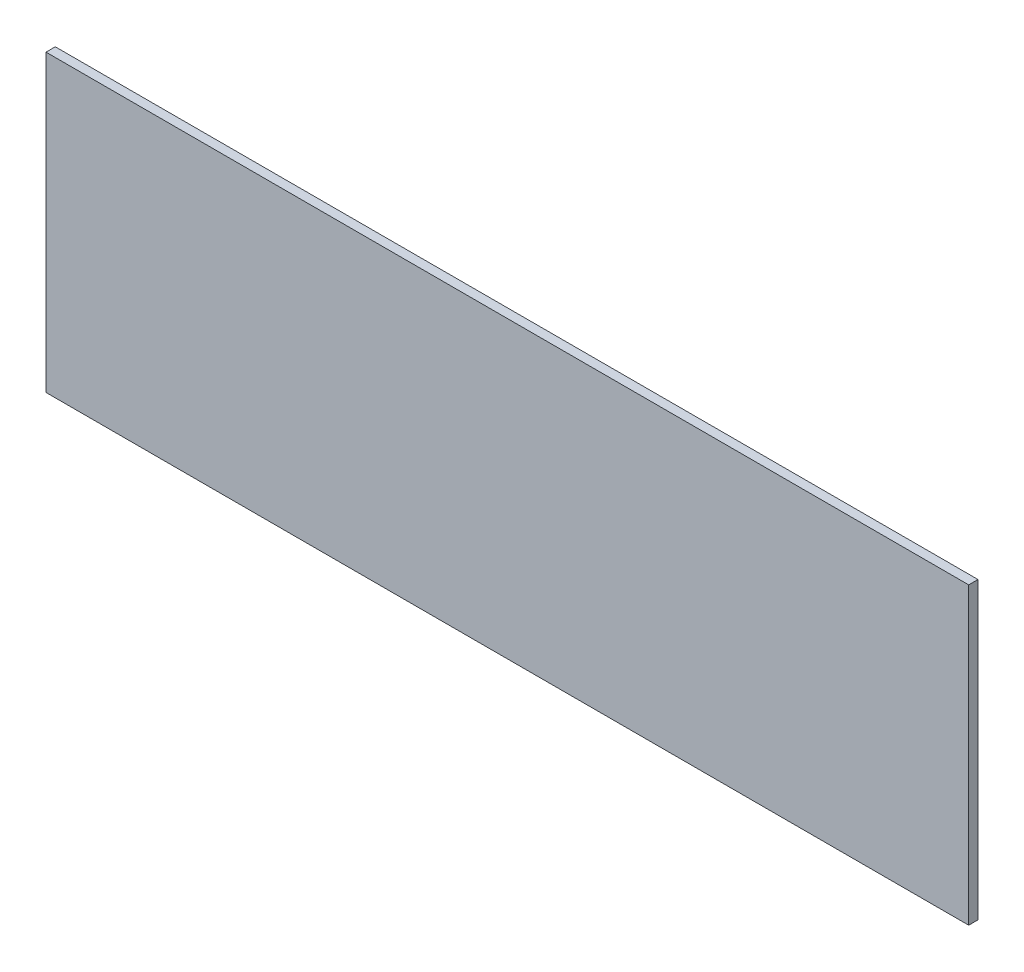
ISO-10303-21;
HEADER;
FILE_DESCRIPTION(('STEP AP214'),'2;1');
FILE_NAME('part.step','',(''),(''),'','','');
FILE_SCHEMA(('AUTOMOTIVE_DESIGN { 1 0 10303 214 1 1 1 1 }'));
ENDSEC;
DATA;
#1=APPLICATION_CONTEXT('core data for automotive mechanical design processes');
#2=APPLICATION_PROTOCOL_DEFINITION('international standard','automotive_design',2000,#1);
#3=PRODUCT_CONTEXT('',#1,'mechanical');
#4=PRODUCT('Part','Part','',(#3));
#5=PRODUCT_RELATED_PRODUCT_CATEGORY('part','',(#4));
#6=PRODUCT_DEFINITION_FORMATION('','',#4);
#7=PRODUCT_DEFINITION_CONTEXT('part definition',#1,'design');
#8=PRODUCT_DEFINITION('design','',#6,#7);
#9=PRODUCT_DEFINITION_SHAPE('','',#8);
#10=(LENGTH_UNIT() NAMED_UNIT(*) SI_UNIT(.MILLI.,.METRE.));
#11=(NAMED_UNIT(*) PLANE_ANGLE_UNIT() SI_UNIT($,.RADIAN.));
#12=(NAMED_UNIT(*) SI_UNIT($,.STERADIAN.) SOLID_ANGLE_UNIT());
#13=UNCERTAINTY_MEASURE_WITH_UNIT(LENGTH_MEASURE(1.E-05),#10,'distance_accuracy_value','');
#14=(GEOMETRIC_REPRESENTATION_CONTEXT(3) GLOBAL_UNCERTAINTY_ASSIGNED_CONTEXT((#13)) GLOBAL_UNIT_ASSIGNED_CONTEXT((#10,
#11,#12)) REPRESENTATION_CONTEXT('',''));
#15=CARTESIAN_POINT('',(0.,0.,0.));
#16=DIRECTION('',(0.,0.,1.));
#17=DIRECTION('',(1.,0.,0.));
#18=AXIS2_PLACEMENT_3D('',#15,#16,#17);
#19=CARTESIAN_POINT('',(150.078,-60.96,3.));
#20=DIRECTION('',(0.,-1.,0.));
#21=DIRECTION('',(1.,0.,0.));
#22=AXIS2_PLACEMENT_3D('',#19,#20,#21);
#23=PLANE('',#22);
#24=DIRECTION('',(-1.,0.,0.));
#25=VECTOR('',#24,1.);
#26=CARTESIAN_POINT('',(150.078,-60.96,0.));
#27=LINE('',#26,#25);
#28=CARTESIAN_POINT('',(150.078,-60.96,0.));
#29=VERTEX_POINT('',#28);
#30=CARTESIAN_POINT('',(-148.082,-60.96,0.));
#31=VERTEX_POINT('',#30);
#32=EDGE_CURVE('E114',#29,#31,#27,.T.);
#33=ORIENTED_EDGE('',*,*,#32,.F.);
#34=DIRECTION('',(0.,0.,-1.));
#35=VECTOR('',#34,1.);
#36=CARTESIAN_POINT('',(150.078,-60.96,3.));
#37=LINE('',#36,#35);
#38=CARTESIAN_POINT('',(150.078,-60.96,3.));
#39=VERTEX_POINT('',#38);
#40=EDGE_CURVE('E11',#39,#29,#37,.T.);
#41=ORIENTED_EDGE('',*,*,#40,.F.);
#42=DIRECTION('',(-1.,0.,0.));
#43=VECTOR('',#42,1.);
#44=CARTESIAN_POINT('',(150.078,-60.96,3.));
#45=LINE('',#44,#43);
#46=CARTESIAN_POINT('',(-148.082,-60.96,3.));
#47=VERTEX_POINT('',#46);
#48=EDGE_CURVE('E106',#39,#47,#45,.T.);
#49=ORIENTED_EDGE('',*,*,#48,.T.);
#50=DIRECTION('',(0.,0.,-1.));
#51=VECTOR('',#50,1.);
#52=CARTESIAN_POINT('',(-148.082,-60.96,3.));
#53=LINE('',#52,#51);
#54=EDGE_CURVE('E46',#47,#31,#53,.T.);
#55=ORIENTED_EDGE('',*,*,#54,.T.);
#56=EDGE_LOOP('',(#33,#41,#49,#55));
#57=FACE_BOUND('',#56,.T.);
#58=ADVANCED_FACE('F43',(#57),#23,.T.);
#59=CARTESIAN_POINT('',(150.078,-60.96,3.));
#60=DIRECTION('',(-1.,0.,0.));
#61=DIRECTION('',(0.,0.,1.));
#62=AXIS2_PLACEMENT_3D('',#59,#60,#61);
#63=PLANE('',#62);
#64=DIRECTION('',(0.,1.,0.));
#65=VECTOR('',#64,1.);
#66=CARTESIAN_POINT('',(150.078,-60.96,0.));
#67=LINE('',#66,#65);
#68=CARTESIAN_POINT('',(150.078,34.29,0.));
#69=VERTEX_POINT('',#68);
#70=EDGE_CURVE('E109',#29,#69,#67,.T.);
#71=ORIENTED_EDGE('',*,*,#70,.T.);
#72=DIRECTION('',(0.,0.,-1.));
#73=VECTOR('',#72,1.);
#74=CARTESIAN_POINT('',(150.078,34.29,3.));
#75=LINE('',#74,#73);
#76=CARTESIAN_POINT('',(150.078,34.29,3.));
#77=VERTEX_POINT('',#76);
#78=EDGE_CURVE('E53',#77,#69,#75,.T.);
#79=ORIENTED_EDGE('',*,*,#78,.F.);
#80=DIRECTION('',(0.,1.,0.));
#81=VECTOR('',#80,1.);
#82=CARTESIAN_POINT('',(150.078,-60.96,3.));
#83=LINE('',#82,#81);
#84=EDGE_CURVE('E101',#39,#77,#83,.T.);
#85=ORIENTED_EDGE('',*,*,#84,.F.);
#86=ORIENTED_EDGE('',*,*,#40,.T.);
#87=EDGE_LOOP('',(#71,#79,#85,#86));
#88=FACE_BOUND('',#87,.T.);
#89=ADVANCED_FACE('F129',(#88),#63,.F.);
#90=CARTESIAN_POINT('',(-148.082,34.29,3.));
#91=DIRECTION('',(0.,1.,0.));
#92=DIRECTION('',(-1.,0.,0.));
#93=AXIS2_PLACEMENT_3D('',#90,#91,#92);
#94=PLANE('',#93);
#95=DIRECTION('',(1.,0.,0.));
#96=VECTOR('',#95,1.);
#97=CARTESIAN_POINT('',(-148.082,34.29,0.));
#98=LINE('',#97,#96);
#99=CARTESIAN_POINT('',(-148.082,34.29,0.));
#100=VERTEX_POINT('',#99);
#101=EDGE_CURVE('E94',#100,#69,#98,.T.);
#102=ORIENTED_EDGE('',*,*,#101,.F.);
#103=DIRECTION('',(0.,0.,-1.));
#104=VECTOR('',#103,1.);
#105=CARTESIAN_POINT('',(-148.082,34.29,3.));
#106=LINE('',#105,#104);
#107=CARTESIAN_POINT('',(-148.082,34.29,3.));
#108=VERTEX_POINT('',#107);
#109=EDGE_CURVE('E89',#108,#100,#106,.T.);
#110=ORIENTED_EDGE('',*,*,#109,.F.);
#111=DIRECTION('',(1.,0.,0.));
#112=VECTOR('',#111,1.);
#113=CARTESIAN_POINT('',(-148.082,34.29,3.));
#114=LINE('',#113,#112);
#115=EDGE_CURVE('E92',#108,#77,#114,.T.);
#116=ORIENTED_EDGE('',*,*,#115,.T.);
#117=ORIENTED_EDGE('',*,*,#78,.T.);
#118=EDGE_LOOP('',(#102,#110,#116,#117));
#119=FACE_BOUND('',#118,.T.);
#120=ADVANCED_FACE('F91',(#119),#94,.T.);
#121=CARTESIAN_POINT('',(-148.082,-60.96,3.));
#122=DIRECTION('',(-1.,0.,0.));
#123=DIRECTION('',(0.,0.,1.));
#124=AXIS2_PLACEMENT_3D('',#121,#122,#123);
#125=PLANE('',#124);
#126=DIRECTION('',(0.,1.,0.));
#127=VECTOR('',#126,1.);
#128=CARTESIAN_POINT('',(-148.082,-60.96,0.));
#129=LINE('',#128,#127);
#130=EDGE_CURVE('E118',#31,#100,#129,.T.);
#131=ORIENTED_EDGE('',*,*,#130,.F.);
#132=ORIENTED_EDGE('',*,*,#54,.F.);
#133=DIRECTION('',(0.,1.,0.));
#134=VECTOR('',#133,1.);
#135=CARTESIAN_POINT('',(-148.082,-60.96,3.));
#136=LINE('',#135,#134);
#137=EDGE_CURVE('E100',#47,#108,#136,.T.);
#138=ORIENTED_EDGE('',*,*,#137,.T.);
#139=ORIENTED_EDGE('',*,*,#109,.T.);
#140=EDGE_LOOP('',(#131,#132,#138,#139));
#141=FACE_BOUND('',#140,.T.);
#142=ADVANCED_FACE('F104',(#141),#125,.T.);
#143=CARTESIAN_POINT('',(0.,0.,3.));
#144=DIRECTION('',(0.,0.,-1.));
#145=DIRECTION('',(-1.,0.,0.));
#146=AXIS2_PLACEMENT_3D('',#143,#144,#145);
#147=PLANE('',#146);
#148=ORIENTED_EDGE('',*,*,#48,.F.);
#149=ORIENTED_EDGE('',*,*,#84,.T.);
#150=ORIENTED_EDGE('',*,*,#115,.F.);
#151=ORIENTED_EDGE('',*,*,#137,.F.);
#152=EDGE_LOOP('',(#148,#149,#150,#151));
#153=FACE_BOUND('',#152,.T.);
#154=ADVANCED_FACE('F99',(#153),#147,.F.);
#155=CARTESIAN_POINT('',(0.,0.,0.));
#156=DIRECTION('',(0.,0.,-1.));
#157=DIRECTION('',(-1.,0.,0.));
#158=AXIS2_PLACEMENT_3D('',#155,#156,#157);
#159=PLANE('',#158);
#160=ORIENTED_EDGE('',*,*,#32,.T.);
#161=ORIENTED_EDGE('',*,*,#130,.T.);
#162=ORIENTED_EDGE('',*,*,#101,.T.);
#163=ORIENTED_EDGE('',*,*,#70,.F.);
#164=EDGE_LOOP('',(#160,#161,#162,#163));
#165=FACE_BOUND('',#164,.T.);
#166=ADVANCED_FACE('F128',(#165),#159,.T.);
#167=CLOSED_SHELL('',(#58,#89,#120,#142,#154,#166));
#168=MANIFOLD_SOLID_BREP('B2',#167);
#169=ADVANCED_BREP_SHAPE_REPRESENTATION('',(#18,#168),#14);
#170=SHAPE_DEFINITION_REPRESENTATION(#9,#169);
ENDSEC;
END-ISO-10303-21;
